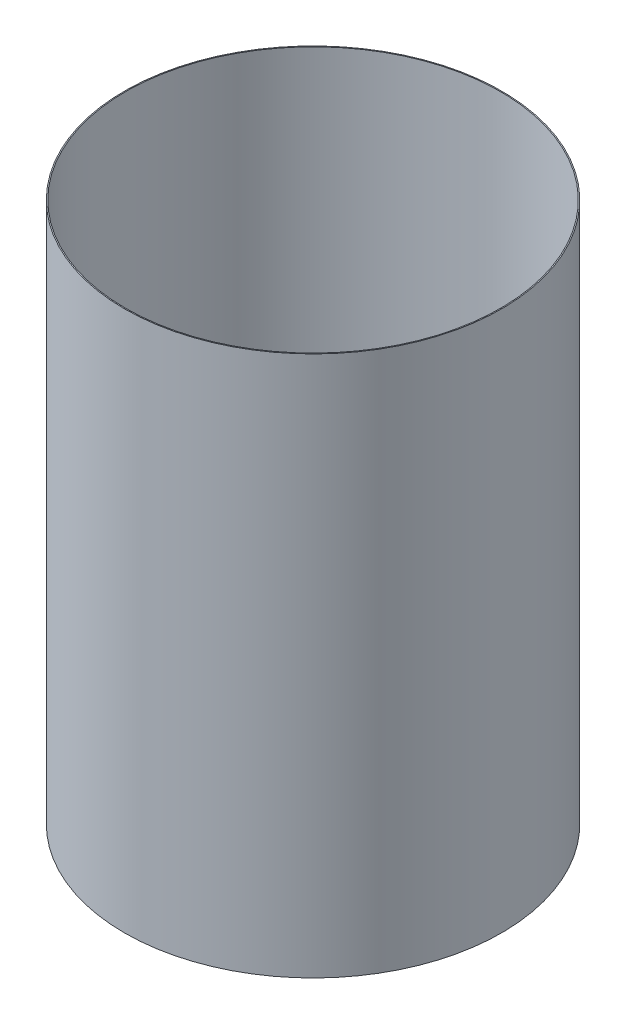
ISO-10303-21;
HEADER;
FILE_DESCRIPTION(('STEP AP214'),'2;1');
FILE_NAME('part.step','',(''),(''),'','','');
FILE_SCHEMA(('AUTOMOTIVE_DESIGN { 1 0 10303 214 1 1 1 1 }'));
ENDSEC;
DATA;
#1=APPLICATION_CONTEXT('core data for automotive mechanical design processes');
#2=APPLICATION_PROTOCOL_DEFINITION('international standard','automotive_design',2000,#1);
#3=PRODUCT_CONTEXT('',#1,'mechanical');
#4=PRODUCT('Part','Part','',(#3));
#5=PRODUCT_RELATED_PRODUCT_CATEGORY('part','',(#4));
#6=PRODUCT_DEFINITION_FORMATION('','',#4);
#7=PRODUCT_DEFINITION_CONTEXT('part definition',#1,'design');
#8=PRODUCT_DEFINITION('design','',#6,#7);
#9=PRODUCT_DEFINITION_SHAPE('','',#8);
#10=(LENGTH_UNIT() NAMED_UNIT(*) SI_UNIT(.MILLI.,.METRE.));
#11=(NAMED_UNIT(*) PLANE_ANGLE_UNIT() SI_UNIT($,.RADIAN.));
#12=(NAMED_UNIT(*) SI_UNIT($,.STERADIAN.) SOLID_ANGLE_UNIT());
#13=UNCERTAINTY_MEASURE_WITH_UNIT(LENGTH_MEASURE(1.E-05),#10,'distance_accuracy_value','');
#14=(GEOMETRIC_REPRESENTATION_CONTEXT(3) GLOBAL_UNCERTAINTY_ASSIGNED_CONTEXT((#13)) GLOBAL_UNIT_ASSIGNED_CONTEXT((#10,
#11,#12)) REPRESENTATION_CONTEXT('',''));
#15=CARTESIAN_POINT('',(0.,0.,0.));
#16=DIRECTION('',(0.,0.,1.));
#17=DIRECTION('',(1.,0.,0.));
#18=AXIS2_PLACEMENT_3D('',#15,#16,#17);
#19=CARTESIAN_POINT('',(0.,55.,0.));
#20=DIRECTION('',(0.,1.,0.));
#21=DIRECTION('',(0.,0.,1.));
#22=AXIS2_PLACEMENT_3D('',#19,#20,#21);
#23=CYLINDRICAL_SURFACE('',#22,46.53915);
#24=CARTESIAN_POINT('',(0.,-153.255914232196,0.));
#25=DIRECTION('',(0.,1.,0.));
#26=DIRECTION('',(0.,0.,1.));
#27=AXIS2_PLACEMENT_3D('',#24,#25,#26);
#28=CIRCLE('',#27,46.53915);
#29=CARTESIAN_POINT('',(0.,-153.255914232196,46.53915));
#30=VERTEX_POINT('',#29);
#31=EDGE_CURVE('E44',#30,#30,#28,.T.);
#32=ORIENTED_EDGE('',*,*,#31,.T.);
#33=EDGE_LOOP('',(#32));
#34=FACE_BOUND('',#33,.T.);
#35=CARTESIAN_POINT('',(0.,-19.905914232196,0.));
#36=DIRECTION('',(0.,1.,0.));
#37=DIRECTION('',(0.,0.,1.));
#38=AXIS2_PLACEMENT_3D('',#35,#36,#37);
#39=CIRCLE('',#38,46.53915);
#40=CARTESIAN_POINT('',(0.,-19.905914232196,46.53915));
#41=VERTEX_POINT('',#40);
#42=EDGE_CURVE('E10',#41,#41,#39,.T.);
#43=ORIENTED_EDGE('',*,*,#42,.F.);
#44=EDGE_LOOP('',(#43));
#45=FACE_BOUND('',#44,.T.);
#46=ADVANCED_FACE('F30',(#34,#45),#23,.T.);
#47=CARTESIAN_POINT('',(-46.53915,-19.905914232196,0.));
#48=DIRECTION('',(0.,-1.,0.));
#49=DIRECTION('',(0.,0.,-1.));
#50=AXIS2_PLACEMENT_3D('',#47,#48,#49);
#51=PLANE('',#50);
#52=CARTESIAN_POINT('',(0.,-19.905914232196,0.));
#53=DIRECTION('',(0.,1.,0.));
#54=DIRECTION('',(0.,0.,1.));
#55=AXIS2_PLACEMENT_3D('',#52,#53,#54);
#56=CIRCLE('',#55,46.28515);
#57=CARTESIAN_POINT('',(0.,-19.905914232196,46.28515));
#58=VERTEX_POINT('',#57);
#59=EDGE_CURVE('E36',#58,#58,#56,.T.);
#60=ORIENTED_EDGE('',*,*,#59,.F.);
#61=EDGE_LOOP('',(#60));
#62=FACE_BOUND('',#61,.T.);
#63=ORIENTED_EDGE('',*,*,#42,.T.);
#64=EDGE_LOOP('',(#63));
#65=FACE_BOUND('',#64,.T.);
#66=ADVANCED_FACE('F60',(#62,#65),#51,.F.);
#67=CARTESIAN_POINT('',(0.,55.,0.));
#68=DIRECTION('',(0.,1.,0.));
#69=DIRECTION('',(0.,0.,1.));
#70=AXIS2_PLACEMENT_3D('',#67,#68,#69);
#71=CYLINDRICAL_SURFACE('',#70,46.28515);
#72=CARTESIAN_POINT('',(0.,-153.255914232196,0.));
#73=DIRECTION('',(0.,1.,0.));
#74=DIRECTION('',(0.,0.,1.));
#75=AXIS2_PLACEMENT_3D('',#72,#73,#74);
#76=CIRCLE('',#75,46.28515);
#77=CARTESIAN_POINT('',(0.,-153.255914232196,46.28515));
#78=VERTEX_POINT('',#77);
#79=EDGE_CURVE('E40',#78,#78,#76,.T.);
#80=ORIENTED_EDGE('',*,*,#79,.F.);
#81=EDGE_LOOP('',(#80));
#82=FACE_BOUND('',#81,.T.);
#83=ORIENTED_EDGE('',*,*,#59,.T.);
#84=EDGE_LOOP('',(#83));
#85=FACE_BOUND('',#84,.T.);
#86=ADVANCED_FACE('F55',(#82,#85),#71,.F.);
#87=CARTESIAN_POINT('',(-46.28515,-153.255914232196,0.));
#88=DIRECTION('',(0.,1.,0.));
#89=DIRECTION('',(0.,0.,1.));
#90=AXIS2_PLACEMENT_3D('',#87,#88,#89);
#91=PLANE('',#90);
#92=ORIENTED_EDGE('',*,*,#31,.F.);
#93=EDGE_LOOP('',(#92));
#94=FACE_BOUND('',#93,.T.);
#95=ORIENTED_EDGE('',*,*,#79,.T.);
#96=EDGE_LOOP('',(#95));
#97=FACE_BOUND('',#96,.T.);
#98=ADVANCED_FACE('F52',(#94,#97),#91,.F.);
#99=CLOSED_SHELL('',(#46,#66,#86,#98));
#100=MANIFOLD_SOLID_BREP('B2',#99);
#101=ADVANCED_BREP_SHAPE_REPRESENTATION('',(#18,#100),#14);
#102=SHAPE_DEFINITION_REPRESENTATION(#9,#101);
ENDSEC;
END-ISO-10303-21;
